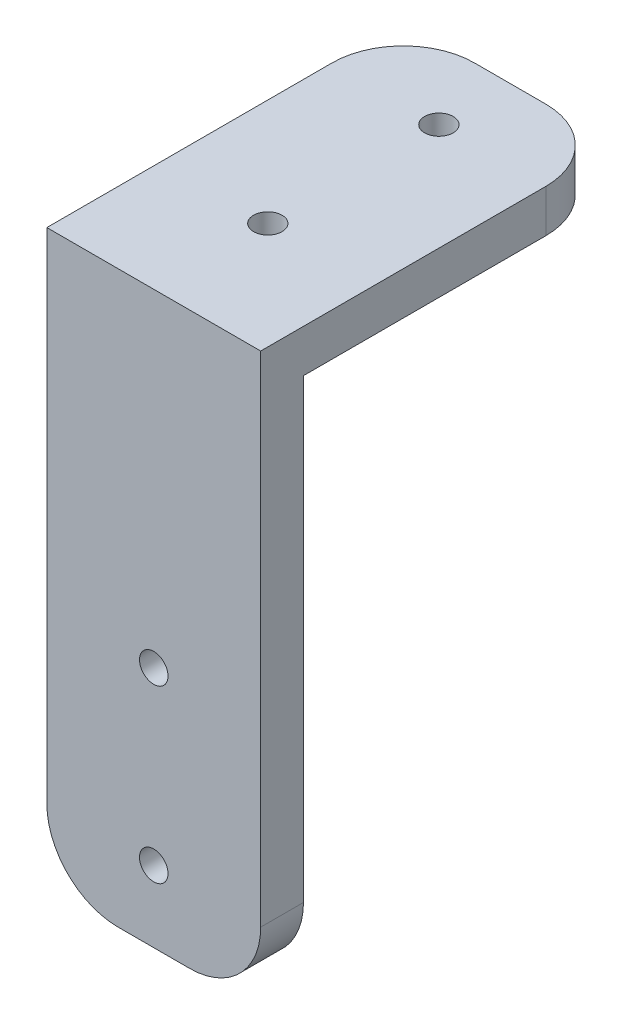
ISO-10303-21;
HEADER;
FILE_DESCRIPTION(('STEP AP214'),'2;1');
FILE_NAME('part.step','',(''),(''),'','','');
FILE_SCHEMA(('AUTOMOTIVE_DESIGN { 1 0 10303 214 1 1 1 1 }'));
ENDSEC;
DATA;
#1=APPLICATION_CONTEXT('core data for automotive mechanical design processes');
#2=APPLICATION_PROTOCOL_DEFINITION('international standard','automotive_design',2000,#1);
#3=PRODUCT_CONTEXT('',#1,'mechanical');
#4=PRODUCT('Part','Part','',(#3));
#5=PRODUCT_RELATED_PRODUCT_CATEGORY('part','',(#4));
#6=PRODUCT_DEFINITION_FORMATION('','',#4);
#7=PRODUCT_DEFINITION_CONTEXT('part definition',#1,'design');
#8=PRODUCT_DEFINITION('design','',#6,#7);
#9=PRODUCT_DEFINITION_SHAPE('','',#8);
#10=(LENGTH_UNIT() NAMED_UNIT(*) SI_UNIT(.MILLI.,.METRE.));
#11=(NAMED_UNIT(*) PLANE_ANGLE_UNIT() SI_UNIT($,.RADIAN.));
#12=(NAMED_UNIT(*) SI_UNIT($,.STERADIAN.) SOLID_ANGLE_UNIT());
#13=UNCERTAINTY_MEASURE_WITH_UNIT(LENGTH_MEASURE(1.E-05),#10,'distance_accuracy_value','');
#14=(GEOMETRIC_REPRESENTATION_CONTEXT(3) GLOBAL_UNCERTAINTY_ASSIGNED_CONTEXT((#13)) GLOBAL_UNIT_ASSIGNED_CONTEXT((#10,
#11,#12)) REPRESENTATION_CONTEXT('',''));
#15=CARTESIAN_POINT('',(0.,0.,0.));
#16=DIRECTION('',(0.,0.,1.));
#17=DIRECTION('',(1.,0.,0.));
#18=AXIS2_PLACEMENT_3D('',#15,#16,#17);
#19=CARTESIAN_POINT('',(5.,5.,0.));
#20=DIRECTION('',(0.,0.,-1.));
#21=DIRECTION('',(-1.,0.,0.));
#22=AXIS2_PLACEMENT_3D('',#19,#20,#21);
#23=PLANE('',#22);
#24=CARTESIAN_POINT('',(7.5,5.,0.));
#25=DIRECTION('',(0.,0.,1.));
#26=DIRECTION('',(1.,0.,0.));
#27=AXIS2_PLACEMENT_3D('',#24,#25,#26);
#28=CIRCLE('',#27,1.);
#29=CARTESIAN_POINT('',(8.5,5.,0.));
#30=VERTEX_POINT('',#29);
#31=EDGE_CURVE('E192',#30,#30,#28,.T.);
#32=ORIENTED_EDGE('',*,*,#31,.T.);
#33=EDGE_LOOP('',(#32));
#34=FACE_BOUND('',#33,.T.);
#35=CARTESIAN_POINT('',(7.5,17.,0.));
#36=DIRECTION('',(0.,0.,1.));
#37=DIRECTION('',(1.,0.,0.));
#38=AXIS2_PLACEMENT_3D('',#35,#36,#37);
#39=CIRCLE('',#38,1.);
#40=CARTESIAN_POINT('',(8.5,17.,0.));
#41=VERTEX_POINT('',#40);
#42=EDGE_CURVE('E188',#41,#41,#39,.T.);
#43=ORIENTED_EDGE('',*,*,#42,.T.);
#44=EDGE_LOOP('',(#43));
#45=FACE_BOUND('',#44,.T.);
#46=DIRECTION('',(0.,-1.,0.));
#47=VECTOR('',#46,1.);
#48=CARTESIAN_POINT('',(0.,5.00000000000004,0.));
#49=LINE('',#48,#47);
#50=CARTESIAN_POINT('',(0.,37.,0.));
#51=VERTEX_POINT('',#50);
#52=CARTESIAN_POINT('',(0.,5.00000000000004,0.));
#53=VERTEX_POINT('',#52);
#54=EDGE_CURVE('E127',#51,#53,#49,.T.);
#55=ORIENTED_EDGE('',*,*,#54,.F.);
#56=DIRECTION('',(1.,0.,0.));
#57=VECTOR('',#56,1.);
#58=CARTESIAN_POINT('',(5.,37.,0.));
#59=LINE('',#58,#57);
#60=CARTESIAN_POINT('',(15.,37.,0.));
#61=VERTEX_POINT('',#60);
#62=EDGE_CURVE('E156',#51,#61,#59,.T.);
#63=ORIENTED_EDGE('',*,*,#62,.T.);
#64=DIRECTION('',(0.,1.,0.));
#65=VECTOR('',#64,1.);
#66=CARTESIAN_POINT('',(15.,5.00000000000004,0.));
#67=LINE('',#66,#65);
#68=CARTESIAN_POINT('',(15.,5.00000000000004,0.));
#69=VERTEX_POINT('',#68);
#70=EDGE_CURVE('E124',#69,#61,#67,.T.);
#71=ORIENTED_EDGE('',*,*,#70,.F.);
#72=CARTESIAN_POINT('',(10.,5.,0.));
#73=DIRECTION('',(0.,0.,1.));
#74=DIRECTION('',(1.,0.,0.));
#75=AXIS2_PLACEMENT_3D('',#72,#73,#74);
#76=CIRCLE('',#75,5.);
#77=CARTESIAN_POINT('',(9.99999999999996,0.,0.));
#78=VERTEX_POINT('',#77);
#79=EDGE_CURVE('E79',#78,#69,#76,.T.);
#80=ORIENTED_EDGE('',*,*,#79,.F.);
#81=DIRECTION('',(1.,0.,0.));
#82=VECTOR('',#81,1.);
#83=CARTESIAN_POINT('',(5.00000000000004,0.,0.));
#84=LINE('',#83,#82);
#85=CARTESIAN_POINT('',(5.00000000000004,0.,0.));
#86=VERTEX_POINT('',#85);
#87=EDGE_CURVE('E131',#86,#78,#84,.T.);
#88=ORIENTED_EDGE('',*,*,#87,.F.);
#89=CARTESIAN_POINT('',(5.,5.,0.));
#90=DIRECTION('',(0.,0.,1.));
#91=DIRECTION('',(-1.,0.,0.));
#92=AXIS2_PLACEMENT_3D('',#89,#90,#91);
#93=CIRCLE('',#92,5.);
#94=EDGE_CURVE('E112',#53,#86,#93,.T.);
#95=ORIENTED_EDGE('',*,*,#94,.F.);
#96=EDGE_LOOP('',(#55,#63,#71,#80,#88,#95));
#97=FACE_BOUND('',#96,.T.);
#98=ADVANCED_FACE('F35',(#34,#45,#97),#23,.T.);
#99=CARTESIAN_POINT('',(5.,5.,3.));
#100=DIRECTION('',(0.,0.,-1.));
#101=DIRECTION('',(-1.,0.,0.));
#102=AXIS2_PLACEMENT_3D('',#99,#100,#101);
#103=PLANE('',#102);
#104=DIRECTION('',(0.,-1.,0.));
#105=VECTOR('',#104,1.);
#106=CARTESIAN_POINT('',(0.,5.00000000000004,3.));
#107=LINE('',#106,#105);
#108=CARTESIAN_POINT('',(0.,40.,3.));
#109=VERTEX_POINT('',#108);
#110=CARTESIAN_POINT('',(0.,5.00000000000004,3.));
#111=VERTEX_POINT('',#110);
#112=EDGE_CURVE('E103',#109,#111,#107,.T.);
#113=ORIENTED_EDGE('',*,*,#112,.T.);
#114=CARTESIAN_POINT('',(5.,5.,3.));
#115=DIRECTION('',(0.,0.,1.));
#116=DIRECTION('',(-1.,0.,0.));
#117=AXIS2_PLACEMENT_3D('',#114,#115,#116);
#118=CIRCLE('',#117,5.);
#119=CARTESIAN_POINT('',(5.00000000000004,0.,3.));
#120=VERTEX_POINT('',#119);
#121=EDGE_CURVE('E95',#111,#120,#118,.T.);
#122=ORIENTED_EDGE('',*,*,#121,.T.);
#123=DIRECTION('',(1.,0.,0.));
#124=VECTOR('',#123,1.);
#125=CARTESIAN_POINT('',(5.00000000000004,0.,3.));
#126=LINE('',#125,#124);
#127=CARTESIAN_POINT('',(9.99999999999996,0.,3.));
#128=VERTEX_POINT('',#127);
#129=EDGE_CURVE('E100',#120,#128,#126,.T.);
#130=ORIENTED_EDGE('',*,*,#129,.T.);
#131=CARTESIAN_POINT('',(10.,5.,3.));
#132=DIRECTION('',(0.,0.,1.));
#133=DIRECTION('',(1.,0.,0.));
#134=AXIS2_PLACEMENT_3D('',#131,#132,#133);
#135=CIRCLE('',#134,5.);
#136=CARTESIAN_POINT('',(15.,5.00000000000004,3.));
#137=VERTEX_POINT('',#136);
#138=EDGE_CURVE('E59',#128,#137,#135,.T.);
#139=ORIENTED_EDGE('',*,*,#138,.T.);
#140=DIRECTION('',(0.,1.,0.));
#141=VECTOR('',#140,1.);
#142=CARTESIAN_POINT('',(15.,5.00000000000004,3.));
#143=LINE('',#142,#141);
#144=CARTESIAN_POINT('',(15.,40.,3.));
#145=VERTEX_POINT('',#144);
#146=EDGE_CURVE('E85',#137,#145,#143,.T.);
#147=ORIENTED_EDGE('',*,*,#146,.T.);
#148=DIRECTION('',(-1.,0.,0.));
#149=VECTOR('',#148,1.);
#150=CARTESIAN_POINT('',(0.,40.,3.));
#151=LINE('',#150,#149);
#152=EDGE_CURVE('E200',#145,#109,#151,.T.);
#153=ORIENTED_EDGE('',*,*,#152,.T.);
#154=EDGE_LOOP('',(#113,#122,#130,#139,#147,#153));
#155=FACE_BOUND('',#154,.T.);
#156=CARTESIAN_POINT('',(7.5,17.,3.));
#157=DIRECTION('',(0.,0.,1.));
#158=DIRECTION('',(1.,0.,0.));
#159=AXIS2_PLACEMENT_3D('',#156,#157,#158);
#160=CIRCLE('',#159,1.);
#161=CARTESIAN_POINT('',(8.5,17.,3.));
#162=VERTEX_POINT('',#161);
#163=EDGE_CURVE('E189',#162,#162,#160,.T.);
#164=ORIENTED_EDGE('',*,*,#163,.F.);
#165=EDGE_LOOP('',(#164));
#166=FACE_BOUND('',#165,.T.);
#167=CARTESIAN_POINT('',(7.5,5.,3.));
#168=DIRECTION('',(0.,0.,1.));
#169=DIRECTION('',(1.,0.,0.));
#170=AXIS2_PLACEMENT_3D('',#167,#168,#169);
#171=CIRCLE('',#170,1.);
#172=CARTESIAN_POINT('',(8.5,5.,3.));
#173=VERTEX_POINT('',#172);
#174=EDGE_CURVE('E128',#173,#173,#171,.T.);
#175=ORIENTED_EDGE('',*,*,#174,.F.);
#176=EDGE_LOOP('',(#175));
#177=FACE_BOUND('',#176,.T.);
#178=ADVANCED_FACE('F97',(#155,#166,#177),#103,.F.);
#179=CARTESIAN_POINT('',(15.,5.00000000000004,3.));
#180=DIRECTION('',(-1.,0.,0.));
#181=DIRECTION('',(0.,0.,1.));
#182=AXIS2_PLACEMENT_3D('',#179,#180,#181);
#183=PLANE('',#182);
#184=DIRECTION('',(0.,0.,-1.));
#185=VECTOR('',#184,1.);
#186=CARTESIAN_POINT('',(15.,40.,3.));
#187=LINE('',#186,#185);
#188=CARTESIAN_POINT('',(15.,40.,-17.));
#189=VERTEX_POINT('',#188);
#190=EDGE_CURVE('E11',#145,#189,#187,.T.);
#191=ORIENTED_EDGE('',*,*,#190,.F.);
#192=ORIENTED_EDGE('',*,*,#146,.F.);
#193=DIRECTION('',(0.,0.,-1.));
#194=VECTOR('',#193,1.);
#195=CARTESIAN_POINT('',(15.,5.00000000000004,3.));
#196=LINE('',#195,#194);
#197=EDGE_CURVE('E120',#137,#69,#196,.T.);
#198=ORIENTED_EDGE('',*,*,#197,.T.);
#199=ORIENTED_EDGE('',*,*,#70,.T.);
#200=DIRECTION('',(0.,0.,1.));
#201=VECTOR('',#200,1.);
#202=CARTESIAN_POINT('',(15.,37.,3.));
#203=LINE('',#202,#201);
#204=CARTESIAN_POINT('',(15.,37.,-17.));
#205=VERTEX_POINT('',#204);
#206=EDGE_CURVE('E178',#205,#61,#203,.T.);
#207=ORIENTED_EDGE('',*,*,#206,.F.);
#208=DIRECTION('',(0.,1.,0.));
#209=VECTOR('',#208,1.);
#210=CARTESIAN_POINT('',(15.,37.,-17.));
#211=LINE('',#210,#209);
#212=EDGE_CURVE('E179',#205,#189,#211,.T.);
#213=ORIENTED_EDGE('',*,*,#212,.T.);
#214=EDGE_LOOP('',(#191,#192,#198,#199,#207,#213));
#215=FACE_BOUND('',#214,.T.);
#216=ADVANCED_FACE('F37',(#215),#183,.F.);
#217=CARTESIAN_POINT('',(0.,40.,3.));
#218=DIRECTION('',(0.,-1.,0.));
#219=DIRECTION('',(0.,0.,-1.));
#220=AXIS2_PLACEMENT_3D('',#217,#218,#219);
#221=PLANE('',#220);
#222=ORIENTED_EDGE('',*,*,#190,.T.);
#223=CARTESIAN_POINT('',(10.,40.,-17.));
#224=DIRECTION('',(0.,-1.,0.));
#225=DIRECTION('',(0.,0.,1.));
#226=AXIS2_PLACEMENT_3D('',#223,#224,#225);
#227=CIRCLE('',#226,5.);
#228=CARTESIAN_POINT('',(9.99999999999996,40.,-22.));
#229=VERTEX_POINT('',#228);
#230=EDGE_CURVE('E167',#229,#189,#227,.T.);
#231=ORIENTED_EDGE('',*,*,#230,.F.);
#232=DIRECTION('',(1.,0.,0.));
#233=VECTOR('',#232,1.);
#234=CARTESIAN_POINT('',(9.99999999999996,40.,-22.));
#235=LINE('',#234,#233);
#236=CARTESIAN_POINT('',(5.00000000000003,40.,-22.));
#237=VERTEX_POINT('',#236);
#238=EDGE_CURVE('E164',#237,#229,#235,.T.);
#239=ORIENTED_EDGE('',*,*,#238,.F.);
#240=CARTESIAN_POINT('',(5.,40.,-17.));
#241=DIRECTION('',(0.,-1.,0.));
#242=DIRECTION('',(0.,0.,1.));
#243=AXIS2_PLACEMENT_3D('',#240,#241,#242);
#244=CIRCLE('',#243,5.);
#245=CARTESIAN_POINT('',(0.,40.,-17.));
#246=VERTEX_POINT('',#245);
#247=EDGE_CURVE('E152',#246,#237,#244,.T.);
#248=ORIENTED_EDGE('',*,*,#247,.F.);
#249=DIRECTION('',(0.,0.,-1.));
#250=VECTOR('',#249,1.);
#251=CARTESIAN_POINT('',(0.,40.,3.));
#252=LINE('',#251,#250);
#253=EDGE_CURVE('E43',#109,#246,#252,.T.);
#254=ORIENTED_EDGE('',*,*,#253,.F.);
#255=ORIENTED_EDGE('',*,*,#152,.F.);
#256=EDGE_LOOP('',(#222,#231,#239,#248,#254,#255));
#257=FACE_BOUND('',#256,.T.);
#258=CARTESIAN_POINT('',(7.5,40.,-17.));
#259=DIRECTION('',(0.,-1.,0.));
#260=DIRECTION('',(0.,0.,-1.));
#261=AXIS2_PLACEMENT_3D('',#258,#259,#260);
#262=CIRCLE('',#261,1.);
#263=CARTESIAN_POINT('',(7.5,40.,-18.));
#264=VERTEX_POINT('',#263);
#265=EDGE_CURVE('E170',#264,#264,#262,.T.);
#266=ORIENTED_EDGE('',*,*,#265,.T.);
#267=EDGE_LOOP('',(#266));
#268=FACE_BOUND('',#267,.T.);
#269=CARTESIAN_POINT('',(7.5,40.,-5.));
#270=DIRECTION('',(0.,-1.,0.));
#271=DIRECTION('',(0.,0.,-1.));
#272=AXIS2_PLACEMENT_3D('',#269,#270,#271);
#273=CIRCLE('',#272,1.);
#274=CARTESIAN_POINT('',(7.5,40.,-6.));
#275=VERTEX_POINT('',#274);
#276=EDGE_CURVE('E238',#275,#275,#273,.T.);
#277=ORIENTED_EDGE('',*,*,#276,.T.);
#278=EDGE_LOOP('',(#277));
#279=FACE_BOUND('',#278,.T.);
#280=ADVANCED_FACE('F160',(#257,#268,#279),#221,.F.);
#281=CARTESIAN_POINT('',(0.,5.00000000000004,3.));
#282=DIRECTION('',(1.,0.,0.));
#283=DIRECTION('',(0.,0.,-1.));
#284=AXIS2_PLACEMENT_3D('',#281,#282,#283);
#285=PLANE('',#284);
#286=ORIENTED_EDGE('',*,*,#253,.T.);
#287=DIRECTION('',(0.,1.,0.));
#288=VECTOR('',#287,1.);
#289=CARTESIAN_POINT('',(0.,37.,-17.));
#290=LINE('',#289,#288);
#291=CARTESIAN_POINT('',(0.,37.,-17.));
#292=VERTEX_POINT('',#291);
#293=EDGE_CURVE('E142',#292,#246,#290,.T.);
#294=ORIENTED_EDGE('',*,*,#293,.F.);
#295=DIRECTION('',(0.,0.,-1.));
#296=VECTOR('',#295,1.);
#297=CARTESIAN_POINT('',(0.,37.,3.));
#298=LINE('',#297,#296);
#299=EDGE_CURVE('E50',#51,#292,#298,.T.);
#300=ORIENTED_EDGE('',*,*,#299,.F.);
#301=ORIENTED_EDGE('',*,*,#54,.T.);
#302=DIRECTION('',(0.,0.,-1.));
#303=VECTOR('',#302,1.);
#304=CARTESIAN_POINT('',(0.,5.00000000000004,3.));
#305=LINE('',#304,#303);
#306=EDGE_CURVE('E115',#111,#53,#305,.T.);
#307=ORIENTED_EDGE('',*,*,#306,.F.);
#308=ORIENTED_EDGE('',*,*,#112,.F.);
#309=EDGE_LOOP('',(#286,#294,#300,#301,#307,#308));
#310=FACE_BOUND('',#309,.T.);
#311=ADVANCED_FACE('F140',(#310),#285,.F.);
#312=CARTESIAN_POINT('',(5.,5.,3.));
#313=DIRECTION('',(0.,0.,-1.));
#314=DIRECTION('',(-1.,0.,0.));
#315=AXIS2_PLACEMENT_3D('',#312,#313,#314);
#316=CYLINDRICAL_SURFACE('',#315,5.);
#317=ORIENTED_EDGE('',*,*,#94,.T.);
#318=DIRECTION('',(0.,0.,-1.));
#319=VECTOR('',#318,1.);
#320=CARTESIAN_POINT('',(5.00000000000004,0.,3.));
#321=LINE('',#320,#319);
#322=EDGE_CURVE('E109',#120,#86,#321,.T.);
#323=ORIENTED_EDGE('',*,*,#322,.F.);
#324=ORIENTED_EDGE('',*,*,#121,.F.);
#325=ORIENTED_EDGE('',*,*,#306,.T.);
#326=EDGE_LOOP('',(#317,#323,#324,#325));
#327=FACE_BOUND('',#326,.T.);
#328=ADVANCED_FACE('F110',(#327),#316,.T.);
#329=CARTESIAN_POINT('',(5.00000000000004,0.,3.));
#330=DIRECTION('',(0.,1.,0.));
#331=DIRECTION('',(0.,0.,1.));
#332=AXIS2_PLACEMENT_3D('',#329,#330,#331);
#333=PLANE('',#332);
#334=ORIENTED_EDGE('',*,*,#87,.T.);
#335=DIRECTION('',(0.,0.,-1.));
#336=VECTOR('',#335,1.);
#337=CARTESIAN_POINT('',(9.99999999999996,0.,3.));
#338=LINE('',#337,#336);
#339=EDGE_CURVE('E116',#128,#78,#338,.T.);
#340=ORIENTED_EDGE('',*,*,#339,.F.);
#341=ORIENTED_EDGE('',*,*,#129,.F.);
#342=ORIENTED_EDGE('',*,*,#322,.T.);
#343=EDGE_LOOP('',(#334,#340,#341,#342));
#344=FACE_BOUND('',#343,.T.);
#345=ADVANCED_FACE('F118',(#344),#333,.F.);
#346=CARTESIAN_POINT('',(10.,5.,3.));
#347=DIRECTION('',(0.,0.,-1.));
#348=DIRECTION('',(-1.,0.,0.));
#349=AXIS2_PLACEMENT_3D('',#346,#347,#348);
#350=CYLINDRICAL_SURFACE('',#349,5.);
#351=ORIENTED_EDGE('',*,*,#79,.T.);
#352=ORIENTED_EDGE('',*,*,#197,.F.);
#353=ORIENTED_EDGE('',*,*,#138,.F.);
#354=ORIENTED_EDGE('',*,*,#339,.T.);
#355=EDGE_LOOP('',(#351,#352,#353,#354));
#356=FACE_BOUND('',#355,.T.);
#357=ADVANCED_FACE('F270',(#356),#350,.T.);
#358=CARTESIAN_POINT('',(7.5,5.,3.));
#359=DIRECTION('',(0.,0.,-1.));
#360=DIRECTION('',(-1.,0.,0.));
#361=AXIS2_PLACEMENT_3D('',#358,#359,#360);
#362=CYLINDRICAL_SURFACE('',#361,1.);
#363=ORIENTED_EDGE('',*,*,#174,.T.);
#364=EDGE_LOOP('',(#363));
#365=FACE_BOUND('',#364,.T.);
#366=ORIENTED_EDGE('',*,*,#31,.F.);
#367=EDGE_LOOP('',(#366));
#368=FACE_BOUND('',#367,.T.);
#369=ADVANCED_FACE('F255',(#365,#368),#362,.F.);
#370=CARTESIAN_POINT('',(7.5,17.,3.));
#371=DIRECTION('',(0.,0.,-1.));
#372=DIRECTION('',(-1.,0.,0.));
#373=AXIS2_PLACEMENT_3D('',#370,#371,#372);
#374=CYLINDRICAL_SURFACE('',#373,1.);
#375=ORIENTED_EDGE('',*,*,#163,.T.);
#376=EDGE_LOOP('',(#375));
#377=FACE_BOUND('',#376,.T.);
#378=ORIENTED_EDGE('',*,*,#42,.F.);
#379=EDGE_LOOP('',(#378));
#380=FACE_BOUND('',#379,.T.);
#381=ADVANCED_FACE('F248',(#377,#380),#374,.F.);
#382=CARTESIAN_POINT('',(10.,37.,-17.));
#383=DIRECTION('',(0.,1.,0.));
#384=DIRECTION('',(0.,0.,1.));
#385=AXIS2_PLACEMENT_3D('',#382,#383,#384);
#386=PLANE('',#385);
#387=ORIENTED_EDGE('',*,*,#62,.F.);
#388=ORIENTED_EDGE('',*,*,#299,.T.);
#389=CARTESIAN_POINT('',(5.,37.,-17.));
#390=DIRECTION('',(0.,-1.,0.));
#391=DIRECTION('',(0.,0.,1.));
#392=AXIS2_PLACEMENT_3D('',#389,#390,#391);
#393=CIRCLE('',#392,5.);
#394=CARTESIAN_POINT('',(5.00000000000003,37.,-22.));
#395=VERTEX_POINT('',#394);
#396=EDGE_CURVE('E155',#292,#395,#393,.T.);
#397=ORIENTED_EDGE('',*,*,#396,.T.);
#398=DIRECTION('',(1.,0.,0.));
#399=VECTOR('',#398,1.);
#400=CARTESIAN_POINT('',(9.99999999999996,37.,-22.));
#401=LINE('',#400,#399);
#402=CARTESIAN_POINT('',(9.99999999999996,37.,-22.));
#403=VERTEX_POINT('',#402);
#404=EDGE_CURVE('E226',#395,#403,#401,.T.);
#405=ORIENTED_EDGE('',*,*,#404,.T.);
#406=CARTESIAN_POINT('',(10.,37.,-17.));
#407=DIRECTION('',(0.,-1.,0.));
#408=DIRECTION('',(0.,0.,1.));
#409=AXIS2_PLACEMENT_3D('',#406,#407,#408);
#410=CIRCLE('',#409,5.);
#411=EDGE_CURVE('E173',#403,#205,#410,.T.);
#412=ORIENTED_EDGE('',*,*,#411,.T.);
#413=ORIENTED_EDGE('',*,*,#206,.T.);
#414=EDGE_LOOP('',(#387,#388,#397,#405,#412,#413));
#415=FACE_BOUND('',#414,.T.);
#416=CARTESIAN_POINT('',(7.5,37.,-17.));
#417=DIRECTION('',(0.,-1.,0.));
#418=DIRECTION('',(0.,0.,-1.));
#419=AXIS2_PLACEMENT_3D('',#416,#417,#418);
#420=CIRCLE('',#419,1.);
#421=CARTESIAN_POINT('',(7.5,37.,-18.));
#422=VERTEX_POINT('',#421);
#423=EDGE_CURVE('E165',#422,#422,#420,.T.);
#424=ORIENTED_EDGE('',*,*,#423,.F.);
#425=EDGE_LOOP('',(#424));
#426=FACE_BOUND('',#425,.T.);
#427=CARTESIAN_POINT('',(7.5,37.,-5.));
#428=DIRECTION('',(0.,-1.,0.));
#429=DIRECTION('',(0.,0.,-1.));
#430=AXIS2_PLACEMENT_3D('',#427,#428,#429);
#431=CIRCLE('',#430,1.);
#432=CARTESIAN_POINT('',(7.5,37.,-6.));
#433=VERTEX_POINT('',#432);
#434=EDGE_CURVE('E236',#433,#433,#431,.T.);
#435=ORIENTED_EDGE('',*,*,#434,.F.);
#436=EDGE_LOOP('',(#435));
#437=FACE_BOUND('',#436,.T.);
#438=ADVANCED_FACE('F228',(#415,#426,#437),#386,.F.);
#439=CARTESIAN_POINT('',(5.,37.,-17.));
#440=DIRECTION('',(0.,1.,0.));
#441=DIRECTION('',(0.,0.,1.));
#442=AXIS2_PLACEMENT_3D('',#439,#440,#441);
#443=CYLINDRICAL_SURFACE('',#442,5.);
#444=ORIENTED_EDGE('',*,*,#247,.T.);
#445=DIRECTION('',(0.,1.,0.));
#446=VECTOR('',#445,1.);
#447=CARTESIAN_POINT('',(5.00000000000003,37.,-22.));
#448=LINE('',#447,#446);
#449=EDGE_CURVE('E157',#395,#237,#448,.T.);
#450=ORIENTED_EDGE('',*,*,#449,.F.);
#451=ORIENTED_EDGE('',*,*,#396,.F.);
#452=ORIENTED_EDGE('',*,*,#293,.T.);
#453=EDGE_LOOP('',(#444,#450,#451,#452));
#454=FACE_BOUND('',#453,.T.);
#455=ADVANCED_FACE('F150',(#454),#443,.T.);
#456=CARTESIAN_POINT('',(9.99999999999996,37.,-22.));
#457=DIRECTION('',(0.,0.,1.));
#458=DIRECTION('',(1.,0.,0.));
#459=AXIS2_PLACEMENT_3D('',#456,#457,#458);
#460=PLANE('',#459);
#461=ORIENTED_EDGE('',*,*,#238,.T.);
#462=DIRECTION('',(0.,1.,0.));
#463=VECTOR('',#462,1.);
#464=CARTESIAN_POINT('',(9.99999999999996,37.,-22.));
#465=LINE('',#464,#463);
#466=EDGE_CURVE('E182',#403,#229,#465,.T.);
#467=ORIENTED_EDGE('',*,*,#466,.F.);
#468=ORIENTED_EDGE('',*,*,#404,.F.);
#469=ORIENTED_EDGE('',*,*,#449,.T.);
#470=EDGE_LOOP('',(#461,#467,#468,#469));
#471=FACE_BOUND('',#470,.T.);
#472=ADVANCED_FACE('F224',(#471),#460,.F.);
#473=CARTESIAN_POINT('',(10.,37.,-17.));
#474=DIRECTION('',(0.,1.,0.));
#475=DIRECTION('',(0.,0.,1.));
#476=AXIS2_PLACEMENT_3D('',#473,#474,#475);
#477=CYLINDRICAL_SURFACE('',#476,5.);
#478=ORIENTED_EDGE('',*,*,#230,.T.);
#479=ORIENTED_EDGE('',*,*,#212,.F.);
#480=ORIENTED_EDGE('',*,*,#411,.F.);
#481=ORIENTED_EDGE('',*,*,#466,.T.);
#482=EDGE_LOOP('',(#478,#479,#480,#481));
#483=FACE_BOUND('',#482,.T.);
#484=ADVANCED_FACE('F211',(#483),#477,.T.);
#485=CARTESIAN_POINT('',(7.5,37.,-17.));
#486=DIRECTION('',(0.,1.,0.));
#487=DIRECTION('',(0.,0.,1.));
#488=AXIS2_PLACEMENT_3D('',#485,#486,#487);
#489=CYLINDRICAL_SURFACE('',#488,1.);
#490=ORIENTED_EDGE('',*,*,#423,.T.);
#491=EDGE_LOOP('',(#490));
#492=FACE_BOUND('',#491,.T.);
#493=ORIENTED_EDGE('',*,*,#265,.F.);
#494=EDGE_LOOP('',(#493));
#495=FACE_BOUND('',#494,.T.);
#496=ADVANCED_FACE('F361',(#492,#495),#489,.F.);
#497=CARTESIAN_POINT('',(7.5,37.,-5.));
#498=DIRECTION('',(0.,1.,0.));
#499=DIRECTION('',(0.,0.,1.));
#500=AXIS2_PLACEMENT_3D('',#497,#498,#499);
#501=CYLINDRICAL_SURFACE('',#500,1.);
#502=ORIENTED_EDGE('',*,*,#434,.T.);
#503=EDGE_LOOP('',(#502));
#504=FACE_BOUND('',#503,.T.);
#505=ORIENTED_EDGE('',*,*,#276,.F.);
#506=EDGE_LOOP('',(#505));
#507=FACE_BOUND('',#506,.T.);
#508=ADVANCED_FACE('F244',(#504,#507),#501,.F.);
#509=CLOSED_SHELL('',(#98,#178,#216,#280,#311,#328,#345,#357,#369,#381,#438,#455,#472,#484,#496,#508));
#510=MANIFOLD_SOLID_BREP('B2',#509);
#511=ADVANCED_BREP_SHAPE_REPRESENTATION('',(#18,#510),#14);
#512=SHAPE_DEFINITION_REPRESENTATION(#9,#511);
ENDSEC;
END-ISO-10303-21;
